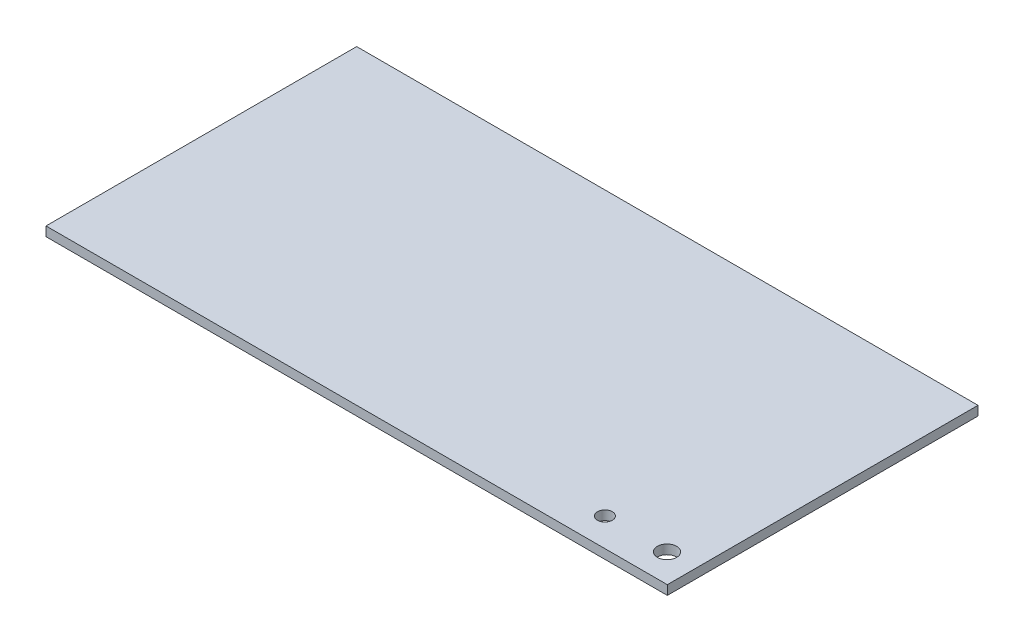
ISO-10303-21;
HEADER;
FILE_DESCRIPTION(('STEP AP214'),'2;1');
FILE_NAME('part.step','',(''),(''),'','','');
FILE_SCHEMA(('AUTOMOTIVE_DESIGN { 1 0 10303 214 1 1 1 1 }'));
ENDSEC;
DATA;
#1=APPLICATION_CONTEXT('core data for automotive mechanical design processes');
#2=APPLICATION_PROTOCOL_DEFINITION('international standard','automotive_design',2000,#1);
#3=PRODUCT_CONTEXT('',#1,'mechanical');
#4=PRODUCT('Part','Part','',(#3));
#5=PRODUCT_RELATED_PRODUCT_CATEGORY('part','',(#4));
#6=PRODUCT_DEFINITION_FORMATION('','',#4);
#7=PRODUCT_DEFINITION_CONTEXT('part definition',#1,'design');
#8=PRODUCT_DEFINITION('design','',#6,#7);
#9=PRODUCT_DEFINITION_SHAPE('','',#8);
#10=(LENGTH_UNIT() NAMED_UNIT(*) SI_UNIT(.MILLI.,.METRE.));
#11=(NAMED_UNIT(*) PLANE_ANGLE_UNIT() SI_UNIT($,.RADIAN.));
#12=(NAMED_UNIT(*) SI_UNIT($,.STERADIAN.) SOLID_ANGLE_UNIT());
#13=UNCERTAINTY_MEASURE_WITH_UNIT(LENGTH_MEASURE(1.E-05),#10,'distance_accuracy_value','');
#14=(GEOMETRIC_REPRESENTATION_CONTEXT(3) GLOBAL_UNCERTAINTY_ASSIGNED_CONTEXT((#13)) GLOBAL_UNIT_ASSIGNED_CONTEXT((#10,
#11,#12)) REPRESENTATION_CONTEXT('',''));
#15=CARTESIAN_POINT('',(0.,0.,0.));
#16=DIRECTION('',(0.,0.,1.));
#17=DIRECTION('',(1.,0.,0.));
#18=AXIS2_PLACEMENT_3D('',#15,#16,#17);
#19=CARTESIAN_POINT('',(4460.28571428572,3.81,-2385.71428571429));
#20=DIRECTION('',(1.,0.,0.));
#21=DIRECTION('',(0.,0.,-1.));
#22=AXIS2_PLACEMENT_3D('',#19,#20,#21);
#23=PLANE('',#22);
#24=DIRECTION('',(0.,0.,1.));
#25=VECTOR('',#24,1.);
#26=CARTESIAN_POINT('',(4460.28571428572,0.,-2385.71428571429));
#27=LINE('',#26,#25);
#28=CARTESIAN_POINT('',(4460.28571428572,0.,-2385.71428571429));
#29=VERTEX_POINT('',#28);
#30=CARTESIAN_POINT('',(4460.28571428572,0.,-2258.71428571429));
#31=VERTEX_POINT('',#30);
#32=EDGE_CURVE('E99',#29,#31,#27,.T.);
#33=ORIENTED_EDGE('',*,*,#32,.T.);
#34=DIRECTION('',(0.,-1.,0.));
#35=VECTOR('',#34,1.);
#36=CARTESIAN_POINT('',(4460.28571428572,3.81,-2258.71428571429));
#37=LINE('',#36,#35);
#38=CARTESIAN_POINT('',(4460.28571428572,3.81,-2258.71428571429));
#39=VERTEX_POINT('',#38);
#40=EDGE_CURVE('E11',#39,#31,#37,.T.);
#41=ORIENTED_EDGE('',*,*,#40,.F.);
#42=DIRECTION('',(0.,0.,1.));
#43=VECTOR('',#42,1.);
#44=CARTESIAN_POINT('',(4460.28571428572,3.81,-2385.71428571429));
#45=LINE('',#44,#43);
#46=CARTESIAN_POINT('',(4460.28571428572,3.81,-2385.71428571429));
#47=VERTEX_POINT('',#46);
#48=EDGE_CURVE('E86',#47,#39,#45,.T.);
#49=ORIENTED_EDGE('',*,*,#48,.F.);
#50=DIRECTION('',(0.,-1.,0.));
#51=VECTOR('',#50,1.);
#52=CARTESIAN_POINT('',(4460.28571428572,3.81,-2385.71428571429));
#53=LINE('',#52,#51);
#54=EDGE_CURVE('E95',#47,#29,#53,.T.);
#55=ORIENTED_EDGE('',*,*,#54,.T.);
#56=EDGE_LOOP('',(#33,#41,#49,#55));
#57=FACE_BOUND('',#56,.T.);
#58=ADVANCED_FACE('F33',(#57),#23,.F.);
#59=CARTESIAN_POINT('',(4460.28571428572,3.81,-2258.71428571429));
#60=DIRECTION('',(0.,0.,-1.));
#61=DIRECTION('',(-1.,0.,0.));
#62=AXIS2_PLACEMENT_3D('',#59,#60,#61);
#63=PLANE('',#62);
#64=DIRECTION('',(1.,0.,0.));
#65=VECTOR('',#64,1.);
#66=CARTESIAN_POINT('',(4460.28571428572,0.,-2258.71428571429));
#67=LINE('',#66,#65);
#68=CARTESIAN_POINT('',(4714.28571428572,0.,-2258.71428571429));
#69=VERTEX_POINT('',#68);
#70=EDGE_CURVE('E90',#31,#69,#67,.T.);
#71=ORIENTED_EDGE('',*,*,#70,.T.);
#72=DIRECTION('',(0.,-1.,0.));
#73=VECTOR('',#72,1.);
#74=CARTESIAN_POINT('',(4714.28571428572,3.81,-2258.71428571429));
#75=LINE('',#74,#73);
#76=CARTESIAN_POINT('',(4714.28571428572,3.81,-2258.71428571429));
#77=VERTEX_POINT('',#76);
#78=EDGE_CURVE('E42',#77,#69,#75,.T.);
#79=ORIENTED_EDGE('',*,*,#78,.F.);
#80=DIRECTION('',(1.,0.,0.));
#81=VECTOR('',#80,1.);
#82=CARTESIAN_POINT('',(4460.28571428572,3.81,-2258.71428571429));
#83=LINE('',#82,#81);
#84=EDGE_CURVE('E81',#39,#77,#83,.T.);
#85=ORIENTED_EDGE('',*,*,#84,.F.);
#86=ORIENTED_EDGE('',*,*,#40,.T.);
#87=EDGE_LOOP('',(#71,#79,#85,#86));
#88=FACE_BOUND('',#87,.T.);
#89=ADVANCED_FACE('F89',(#88),#63,.F.);
#90=CARTESIAN_POINT('',(4714.28571428572,3.81,-2385.71428571429));
#91=DIRECTION('',(-1.,0.,0.));
#92=DIRECTION('',(0.,0.,1.));
#93=AXIS2_PLACEMENT_3D('',#90,#91,#92);
#94=PLANE('',#93);
#95=DIRECTION('',(0.,0.,-1.));
#96=VECTOR('',#95,1.);
#97=CARTESIAN_POINT('',(4714.28571428572,0.,-2385.71428571429));
#98=LINE('',#97,#96);
#99=CARTESIAN_POINT('',(4714.28571428572,0.,-2385.71428571429));
#100=VERTEX_POINT('',#99);
#101=EDGE_CURVE('E68',#69,#100,#98,.T.);
#102=ORIENTED_EDGE('',*,*,#101,.T.);
#103=DIRECTION('',(0.,-1.,0.));
#104=VECTOR('',#103,1.);
#105=CARTESIAN_POINT('',(4714.28571428572,3.81,-2385.71428571429));
#106=LINE('',#105,#104);
#107=CARTESIAN_POINT('',(4714.28571428572,3.81,-2385.71428571429));
#108=VERTEX_POINT('',#107);
#109=EDGE_CURVE('E91',#108,#100,#106,.T.);
#110=ORIENTED_EDGE('',*,*,#109,.F.);
#111=DIRECTION('',(0.,0.,-1.));
#112=VECTOR('',#111,1.);
#113=CARTESIAN_POINT('',(4714.28571428572,3.81,-2385.71428571429));
#114=LINE('',#113,#112);
#115=EDGE_CURVE('E84',#77,#108,#114,.T.);
#116=ORIENTED_EDGE('',*,*,#115,.F.);
#117=ORIENTED_EDGE('',*,*,#78,.T.);
#118=EDGE_LOOP('',(#102,#110,#116,#117));
#119=FACE_BOUND('',#118,.T.);
#120=ADVANCED_FACE('F93',(#119),#94,.F.);
#121=CARTESIAN_POINT('',(4460.28571428572,3.81,-2385.71428571429));
#122=DIRECTION('',(0.,0.,1.));
#123=DIRECTION('',(1.,0.,0.));
#124=AXIS2_PLACEMENT_3D('',#121,#122,#123);
#125=PLANE('',#124);
#126=DIRECTION('',(-1.,0.,0.));
#127=VECTOR('',#126,1.);
#128=CARTESIAN_POINT('',(4460.28571428572,0.,-2385.71428571429));
#129=LINE('',#128,#127);
#130=EDGE_CURVE('E74',#100,#29,#129,.T.);
#131=ORIENTED_EDGE('',*,*,#130,.T.);
#132=ORIENTED_EDGE('',*,*,#54,.F.);
#133=DIRECTION('',(-1.,0.,0.));
#134=VECTOR('',#133,1.);
#135=CARTESIAN_POINT('',(4460.28571428572,3.81,-2385.71428571429));
#136=LINE('',#135,#134);
#137=EDGE_CURVE('E51',#108,#47,#136,.T.);
#138=ORIENTED_EDGE('',*,*,#137,.F.);
#139=ORIENTED_EDGE('',*,*,#109,.T.);
#140=EDGE_LOOP('',(#131,#132,#138,#139));
#141=FACE_BOUND('',#140,.T.);
#142=ADVANCED_FACE('F127',(#141),#125,.F.);
#143=CARTESIAN_POINT('',(0.,3.81,0.));
#144=DIRECTION('',(0.,1.,0.));
#145=DIRECTION('',(0.,0.,1.));
#146=AXIS2_PLACEMENT_3D('',#143,#144,#145);
#147=PLANE('',#146);
#148=CARTESIAN_POINT('',(4702.60171428572,3.81,-2270.27128571429));
#149=DIRECTION('',(0.,1.,0.));
#150=DIRECTION('',(0.,0.,1.));
#151=AXIS2_PLACEMENT_3D('',#148,#149,#150);
#152=CIRCLE('',#151,3.93699999999941);
#153=CARTESIAN_POINT('',(4702.60171428572,3.81,-2266.33428571429));
#154=VERTEX_POINT('',#153);
#155=EDGE_CURVE('E116',#154,#154,#152,.T.);
#156=ORIENTED_EDGE('',*,*,#155,.F.);
#157=EDGE_LOOP('',(#156));
#158=FACE_BOUND('',#157,.T.);
#159=CARTESIAN_POINT('',(4677.20171428572,3.81,-2270.27128571429));
#160=DIRECTION('',(0.,1.,0.));
#161=DIRECTION('',(0.,0.,1.));
#162=AXIS2_PLACEMENT_3D('',#159,#160,#161);
#163=CIRCLE('',#162,3.04799999999989);
#164=CARTESIAN_POINT('',(4677.20171428572,3.81,-2267.22328571429));
#165=VERTEX_POINT('',#164);
#166=EDGE_CURVE('E108',#165,#165,#163,.T.);
#167=ORIENTED_EDGE('',*,*,#166,.F.);
#168=EDGE_LOOP('',(#167));
#169=FACE_BOUND('',#168,.T.);
#170=ORIENTED_EDGE('',*,*,#48,.T.);
#171=ORIENTED_EDGE('',*,*,#84,.T.);
#172=ORIENTED_EDGE('',*,*,#115,.T.);
#173=ORIENTED_EDGE('',*,*,#137,.T.);
#174=EDGE_LOOP('',(#170,#171,#172,#173));
#175=FACE_BOUND('',#174,.T.);
#176=ADVANCED_FACE('F82',(#158,#169,#175),#147,.T.);
#177=CARTESIAN_POINT('',(0.,0.,0.));
#178=DIRECTION('',(0.,1.,0.));
#179=DIRECTION('',(0.,0.,1.));
#180=AXIS2_PLACEMENT_3D('',#177,#178,#179);
#181=PLANE('',#180);
#182=CARTESIAN_POINT('',(4702.60171428572,0.,-2270.27128571429));
#183=DIRECTION('',(0.,1.,0.));
#184=DIRECTION('',(0.,0.,1.));
#185=AXIS2_PLACEMENT_3D('',#182,#183,#184);
#186=CIRCLE('',#185,3.93699999999941);
#187=CARTESIAN_POINT('',(4702.60171428572,0.,-2266.33428571429));
#188=VERTEX_POINT('',#187);
#189=EDGE_CURVE('E36',#188,#188,#186,.T.);
#190=ORIENTED_EDGE('',*,*,#189,.T.);
#191=EDGE_LOOP('',(#190));
#192=FACE_BOUND('',#191,.T.);
#193=CARTESIAN_POINT('',(4677.20171428572,0.,-2270.27128571429));
#194=DIRECTION('',(0.,1.,0.));
#195=DIRECTION('',(0.,0.,1.));
#196=AXIS2_PLACEMENT_3D('',#193,#194,#195);
#197=CIRCLE('',#196,3.04799999999989);
#198=CARTESIAN_POINT('',(4677.20171428572,0.,-2267.22328571429));
#199=VERTEX_POINT('',#198);
#200=EDGE_CURVE('E102',#199,#199,#197,.T.);
#201=ORIENTED_EDGE('',*,*,#200,.T.);
#202=EDGE_LOOP('',(#201));
#203=FACE_BOUND('',#202,.T.);
#204=ORIENTED_EDGE('',*,*,#32,.F.);
#205=ORIENTED_EDGE('',*,*,#130,.F.);
#206=ORIENTED_EDGE('',*,*,#101,.F.);
#207=ORIENTED_EDGE('',*,*,#70,.F.);
#208=EDGE_LOOP('',(#204,#205,#206,#207));
#209=FACE_BOUND('',#208,.T.);
#210=ADVANCED_FACE('F126',(#192,#203,#209),#181,.F.);
#211=CARTESIAN_POINT('',(4677.20171428572,-21.59,-2270.27128571429));
#212=DIRECTION('',(0.,1.,0.));
#213=DIRECTION('',(0.,0.,1.));
#214=AXIS2_PLACEMENT_3D('',#211,#212,#213);
#215=CYLINDRICAL_SURFACE('',#214,3.04799999999989);
#216=ORIENTED_EDGE('',*,*,#166,.T.);
#217=EDGE_LOOP('',(#216));
#218=FACE_BOUND('',#217,.T.);
#219=ORIENTED_EDGE('',*,*,#200,.F.);
#220=EDGE_LOOP('',(#219));
#221=FACE_BOUND('',#220,.T.);
#222=ADVANCED_FACE('F133',(#218,#221),#215,.F.);
#223=CARTESIAN_POINT('',(4702.60171428572,-21.59,-2270.27128571429));
#224=DIRECTION('',(0.,1.,0.));
#225=DIRECTION('',(0.,0.,1.));
#226=AXIS2_PLACEMENT_3D('',#223,#224,#225);
#227=CYLINDRICAL_SURFACE('',#226,3.93699999999941);
#228=ORIENTED_EDGE('',*,*,#155,.T.);
#229=EDGE_LOOP('',(#228));
#230=FACE_BOUND('',#229,.T.);
#231=ORIENTED_EDGE('',*,*,#189,.F.);
#232=EDGE_LOOP('',(#231));
#233=FACE_BOUND('',#232,.T.);
#234=ADVANCED_FACE('F121',(#230,#233),#227,.F.);
#235=CLOSED_SHELL('',(#58,#89,#120,#142,#176,#210,#222,#234));
#236=MANIFOLD_SOLID_BREP('B2',#235);
#237=ADVANCED_BREP_SHAPE_REPRESENTATION('',(#18,#236),#14);
#238=SHAPE_DEFINITION_REPRESENTATION(#9,#237);
ENDSEC;
END-ISO-10303-21;
